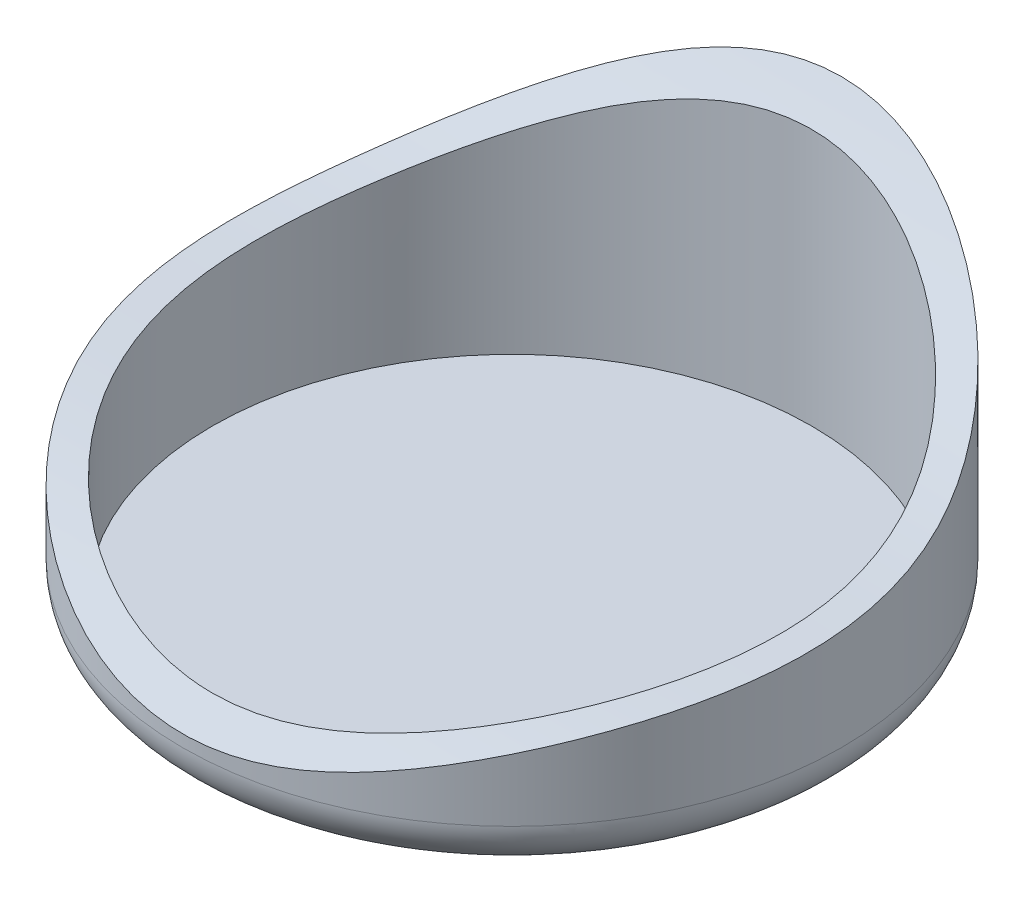
ISO-10303-21;
HEADER;
FILE_DESCRIPTION(('STEP AP214'),'2;1');
FILE_NAME('part.step','',(''),(''),'','','');
FILE_SCHEMA(('AUTOMOTIVE_DESIGN { 1 0 10303 214 1 1 1 1 }'));
ENDSEC;
DATA;
#1=APPLICATION_CONTEXT('core data for automotive mechanical design processes');
#2=APPLICATION_PROTOCOL_DEFINITION('international standard','automotive_design',2000,#1);
#3=PRODUCT_CONTEXT('',#1,'mechanical');
#4=PRODUCT('Part','Part','',(#3));
#5=PRODUCT_RELATED_PRODUCT_CATEGORY('part','',(#4));
#6=PRODUCT_DEFINITION_FORMATION('','',#4);
#7=PRODUCT_DEFINITION_CONTEXT('part definition',#1,'design');
#8=PRODUCT_DEFINITION('design','',#6,#7);
#9=PRODUCT_DEFINITION_SHAPE('','',#8);
#10=(LENGTH_UNIT() NAMED_UNIT(*) SI_UNIT(.MILLI.,.METRE.));
#11=(NAMED_UNIT(*) PLANE_ANGLE_UNIT() SI_UNIT($,.RADIAN.));
#12=(NAMED_UNIT(*) SI_UNIT($,.STERADIAN.) SOLID_ANGLE_UNIT());
#13=UNCERTAINTY_MEASURE_WITH_UNIT(LENGTH_MEASURE(1.E-05),#10,'distance_accuracy_value','');
#14=(GEOMETRIC_REPRESENTATION_CONTEXT(3) GLOBAL_UNCERTAINTY_ASSIGNED_CONTEXT((#13)) GLOBAL_UNIT_ASSIGNED_CONTEXT((#10,
#11,#12)) REPRESENTATION_CONTEXT('',''));
#15=CARTESIAN_POINT('',(0.,0.,0.));
#16=DIRECTION('',(0.,0.,1.));
#17=DIRECTION('',(1.,0.,0.));
#18=AXIS2_PLACEMENT_3D('',#15,#16,#17);
#19=CARTESIAN_POINT('',(0.,50.,0.));
#20=DIRECTION('',(0.,-1.,0.));
#21=DIRECTION('',(0.,0.,-1.));
#22=AXIS2_PLACEMENT_3D('',#19,#20,#21);
#23=CYLINDRICAL_SURFACE('',#22,55.);
#24=CARTESIAN_POINT('',(0.,8.,0.));
#25=DIRECTION('',(0.,1.,0.));
#26=DIRECTION('',(0.,0.,1.));
#27=AXIS2_PLACEMENT_3D('',#24,#25,#26);
#28=CIRCLE('',#27,55.);
#29=CARTESIAN_POINT('',(0.,8.,55.));
#30=VERTEX_POINT('',#29);
#31=EDGE_CURVE('E49',#30,#30,#28,.T.);
#32=ORIENTED_EDGE('',*,*,#31,.T.);
#33=EDGE_LOOP('',(#32));
#34=FACE_BOUND('',#33,.T.);
#35=CARTESIAN_POINT('',(0.,50.,-55.));
#36=CARTESIAN_POINT('',(0.854069115870392,49.999992625064,-54.999996191035));
#37=CARTESIAN_POINT('',(1.70831991411207,49.9777660004917,-54.9800787541194));
#38=CARTESIAN_POINT('',(3.41334942915672,49.8893770497818,-54.9006224824721));
#39=CARTESIAN_POINT('',(4.26412433642764,49.8231752633585,-54.841048062189));
#40=CARTESIAN_POINT('',(5.95779429608254,49.6484593647357,-54.6829784318823));
#41=CARTESIAN_POINT('',(6.80068813200412,49.5399388274347,-54.5844773117295));
#42=CARTESIAN_POINT('',(8.47782313889633,49.2827400179095,-54.3492966156558));
#43=CARTESIAN_POINT('',(9.3120260083913,49.1339288333599,-54.2124906262402));
#44=CARTESIAN_POINT('',(10.9659494369971,48.7996377199141,-53.9022803897119));
#45=CARTESIAN_POINT('',(11.7856723668956,48.614163855537,-53.7288821951405));
#46=CARTESIAN_POINT('',(13.4085593895451,48.2102646362606,-53.3470286634495));
#47=CARTESIAN_POINT('',(14.2117243581065,47.9918410293012,-53.1385751858987));
#48=CARTESIAN_POINT('',(15.7887838466717,47.5292334930132,-52.6913338226463));
#49=CARTESIAN_POINT('',(16.5629312999914,47.2854557145141,-52.4530145337054));
#50=CARTESIAN_POINT('',(18.0926250884293,46.7734391035743,-51.9452249696853));
#51=CARTESIAN_POINT('',(18.8481718760874,46.505200866986,-51.6757554533771));
#52=CARTESIAN_POINT('',(20.3400530494131,45.9479155637186,-51.1069426391914));
#53=CARTESIAN_POINT('',(21.0763875245413,45.6588685939571,-50.8075994804492));
#54=CARTESIAN_POINT('',(22.5292795771078,45.0635328202285,-50.1802502672315));
#55=CARTESIAN_POINT('',(23.245842999863,44.7572491954778,-49.852252806522));
#56=CARTESIAN_POINT('',(24.6592448740862,44.1306319009409,-49.1684650043946));
#57=CARTESIAN_POINT('',(25.3560839326998,43.8102986643984,-48.8126755197273));
#58=CARTESIAN_POINT('',(26.7300087740181,43.1586083349445,-48.074057042306));
#59=CARTESIAN_POINT('',(27.4070929768283,42.8272503648413,-47.6912258952254));
#60=CARTESIAN_POINT('',(29.2782875914583,41.8864853357786,-46.5804967297862));
#61=CARTESIAN_POINT('',(30.4501953752545,41.2678171093686,-45.8227342224061));
#62=CARTESIAN_POINT('',(32.7291915196127,40.0191745639058,-44.2237264055906));
#63=CARTESIAN_POINT('',(33.8362728200181,39.3891990231155,-43.3824720299668));
#64=CARTESIAN_POINT('',(35.9851198478277,38.1312499868894,-41.6173698903432));
#65=CARTESIAN_POINT('',(37.0268453400482,37.5032779463146,-40.6934720809734));
#66=CARTESIAN_POINT('',(39.0419273486149,36.2624289680221,-38.764326917331));
#67=CARTESIAN_POINT('',(40.0152851338796,35.6495517502787,-37.7590810736399));
#68=CARTESIAN_POINT('',(41.5892878261699,34.6431545535262,-36.0033498045493));
#69=CARTESIAN_POINT('',(42.2094213239966,34.2422732776303,-35.2744453649962));
#70=CARTESIAN_POINT('',(43.41478814514,33.4567419740657,-33.7798430810105));
#71=CARTESIAN_POINT('',(44.000021155523,33.072092091944,-33.0141449067797));
#72=CARTESIAN_POINT('',(45.1336837158256,32.3226652097743,-31.4465613871079));
#73=CARTESIAN_POINT('',(45.6821123756887,31.9578886903731,-30.6446751672985));
#74=CARTESIAN_POINT('',(46.739243682609,31.2522636957342,-29.0067535371727));
#75=CARTESIAN_POINT('',(47.2480013361252,30.9113821573175,-28.1707679507125));
#76=CARTESIAN_POINT('',(48.2242394638017,30.2563931325486,-26.4648544639774));
#77=CARTESIAN_POINT('',(48.6917206325427,29.9422851956661,-25.5949271352134));
#78=CARTESIAN_POINT('',(49.5827905112773,29.3442086791091,-23.8228880684401));
#79=CARTESIAN_POINT('',(50.0063826114807,29.0602377714592,-22.9207788235696));
#80=CARTESIAN_POINT('',(50.8084269172449,28.5207954417795,-21.0834732261368));
#81=CARTESIAN_POINT('',(51.1866780361525,28.2654512808639,-20.1481517191868));
#82=CARTESIAN_POINT('',(51.8932263361902,27.7833520468131,-18.251500813062));
#83=CARTESIAN_POINT('',(52.2215175500993,27.5566003893257,-17.2901683232557));
#84=CARTESIAN_POINT('',(52.8257183776272,27.129794061271,-15.3453678902753));
#85=CARTESIAN_POINT('',(53.1016273860588,26.9297396991533,-14.3618996915075));
#86=CARTESIAN_POINT('',(53.599333517663,26.5536262732468,-12.3758067045968));
#87=CARTESIAN_POINT('',(53.8210772584035,26.3775909561619,-11.3731640598427));
#88=CARTESIAN_POINT('',(54.2085382716819,26.0467345655661,-9.3536825026886));
#89=CARTESIAN_POINT('',(54.3742569247168,25.8919129693902,-8.33684394072883));
#90=CARTESIAN_POINT('',(54.648519157302,25.6000976554439,-6.29306704130976));
#91=CARTESIAN_POINT('',(54.7570653485922,25.4631031235167,-5.26612916738858));
#92=CARTESIAN_POINT('',(54.9493621996471,25.1491138797272,-2.77653790213313));
#93=CARTESIAN_POINT('',(55.003932643473,24.9792387214009,-1.31063849075073));
#94=CARTESIAN_POINT('',(54.9956251361627,24.6570605875737,1.62254910854977));
#95=CARTESIAN_POINT('',(54.9327523382722,24.5047568413751,3.08983723270951));
#96=CARTESIAN_POINT('',(54.6897797949711,24.2067816170215,6.01513112153528));
#97=CARTESIAN_POINT('',(54.5096965092104,24.0611092107126,7.47313816050201));
#98=CARTESIAN_POINT('',(54.0335084406365,23.7659055615091,10.3698621247427));
#99=CARTESIAN_POINT('',(53.7373985668483,23.6163741495595,11.8085782007091));
#100=CARTESIAN_POINT('',(53.1356666316899,23.3501024148008,14.236274730053));
#101=CARTESIAN_POINT('',(52.858586443786,23.2366917085476,15.232794792177));
#102=CARTESIAN_POINT('',(52.2490427892081,23.0003627083434,17.2077088567868));
#103=CARTESIAN_POINT('',(51.9165771037337,22.877444033599,18.1861021313492));
#104=CARTESIAN_POINT('',(51.1976708396996,22.6196147810732,20.1212322977192));
#105=CARTESIAN_POINT('',(50.8112301722722,22.4847041835476,21.0779691538673));
#106=CARTESIAN_POINT('',(49.9861537654,22.2009341664183,22.9661835959455));
#107=CARTESIAN_POINT('',(49.5475346563176,22.0520791943765,23.8976691144019));
#108=CARTESIAN_POINT('',(48.6198931015828,21.7389295705646,25.7325245926298));
#109=CARTESIAN_POINT('',(48.130870572264,21.5746348931656,26.635894505728));
#110=CARTESIAN_POINT('',(47.1045359526055,21.2297468825814,28.4115154609878));
#111=CARTESIAN_POINT('',(46.5672254795864,21.0491540952721,29.2837675440209));
#112=CARTESIAN_POINT('',(45.4551023477234,20.6743020373164,30.9814083268508));
#113=CARTESIAN_POINT('',(44.8809858562312,20.4802929308506,31.8073085770574));
#114=CARTESIAN_POINT('',(43.6903491303983,20.0765966559798,33.4239616749198));
#115=CARTESIAN_POINT('',(43.0738286769188,19.8669094065514,34.214714340902));
#116=CARTESIAN_POINT('',(41.8006802299838,19.4328213530191,35.7589788431168));
#117=CARTESIAN_POINT('',(41.1440528782554,19.2084207843301,36.5124912748597));
#118=CARTESIAN_POINT('',(39.7923991441477,18.7462583772949,37.9810704247534));
#119=CARTESIAN_POINT('',(39.0973430589127,18.5084862010798,38.6961065366005));
#120=CARTESIAN_POINT('',(37.671455038648,18.0218322554297,40.0855641657684));
#121=CARTESIAN_POINT('',(36.9406228606016,17.772950410531,40.7599854071345));
#122=CARTESIAN_POINT('',(35.4451939481835,17.2666928541381,42.0669034933099));
#123=CARTESIAN_POINT('',(34.6805966863172,17.0093170099624,42.699399682759));
#124=CARTESIAN_POINT('',(33.0969450368578,16.4816710246908,43.9389616729014));
#125=CARTESIAN_POINT('',(32.2769557261177,16.2112431458961,44.5447660066048));
#126=CARTESIAN_POINT('',(30.6049946211398,15.6685825967561,45.7096539434829));
#127=CARTESIAN_POINT('',(29.7530222098398,15.396349891673,46.268736644567));
#128=CARTESIAN_POINT('',(28.0186610057322,14.854444004396,47.3391295764531));
#129=CARTESIAN_POINT('',(27.1362692348363,14.5847710761219,47.8504351115325));
#130=CARTESIAN_POINT('',(25.3429265957072,14.0529244898544,48.8239358720299));
#131=CARTESIAN_POINT('',(24.4319837463073,13.7907487650694,49.2861447294388));
#132=CARTESIAN_POINT('',(22.5829143970834,13.2790778228051,50.1603200270973));
#133=CARTESIAN_POINT('',(21.6447902463796,13.0295815146204,50.572290793196));
#134=CARTESIAN_POINT('',(19.7430379412461,12.548829016771,51.3445757106649));
#135=CARTESIAN_POINT('',(18.7794133173613,12.3175703195693,51.7048969690511));
#136=CARTESIAN_POINT('',(16.9915345000619,11.9156476221986,52.3165860556892));
#137=CARTESIAN_POINT('',(16.1708849774303,11.7413143381406,52.5760997944323));
#138=CARTESIAN_POINT('',(14.514656234297,11.4125987848676,53.0572167329086));
#139=CARTESIAN_POINT('',(13.6790784833959,11.2582145639639,53.2788236418917));
#140=CARTESIAN_POINT('',(11.9946514135471,10.9725865415723,53.6831303098784));
#141=CARTESIAN_POINT('',(11.1458024024666,10.8413422041489,53.8658309699976));
#142=CARTESIAN_POINT('',(9.43833565310037,10.6051356559163,54.1910672962565));
#143=CARTESIAN_POINT('',(8.57973722629893,10.5001286321153,54.3336714995728));
#144=CARTESIAN_POINT('',(6.85371784863679,10.3186121254354,54.5782583540829));
#145=CARTESIAN_POINT('',(5.98629649605111,10.2421039461854,54.6802391470459));
#146=CARTESIAN_POINT('',(4.24546704219263,10.119527026275,54.8428680719409));
#147=CARTESIAN_POINT('',(3.37205920372628,10.0734569579215,54.9035180067051));
#148=CARTESIAN_POINT('',(1.61878528562685,10.0128400948417,54.9832031339637));
#149=CARTESIAN_POINT('',(0.738907321800054,9.99841842778351,55.0020731445984));
#150=CARTESIAN_POINT('',(-1.02072736531904,10.0018569897273,54.9975658432919));
#151=CARTESIAN_POINT('',(-1.90048407856056,10.0197190996378,54.9741860698053));
#152=CARTESIAN_POINT('',(-3.65659370144804,10.0872466906899,54.8853555574344));
#153=CARTESIAN_POINT('',(-4.53294676752167,10.1369106924284,54.8199067755724));
#154=CARTESIAN_POINT('',(-6.28010291912449,10.2667945152915,54.6473392722672));
#155=CARTESIAN_POINT('',(-7.15089978231031,10.3470439889023,54.5401801106351));
#156=CARTESIAN_POINT('',(-8.88335713143901,10.5360651498042,54.2849208781756));
#157=CARTESIAN_POINT('',(-9.74501732269935,10.6448377541503,54.1368194909953));
#158=CARTESIAN_POINT('',(-11.4567066230267,10.8882806318955,53.8006017387266));
#159=CARTESIAN_POINT('',(-12.3067359922906,11.0229503249247,53.6124862703688));
#160=CARTESIAN_POINT('',(-14.3623301482885,11.3791702468426,53.1063273563798));
#161=CARTESIAN_POINT('',(-15.5606961755749,11.6129505346207,52.7674508790595));
#162=CARTESIAN_POINT('',(-17.9247147863189,12.1181623602449,52.011971017356));
#163=CARTESIAN_POINT('',(-19.090360166475,12.3896021116961,51.5953506700205));
#164=CARTESIAN_POINT('',(-20.811489331001,12.8174731459881,50.9142704246939));
#165=CARTESIAN_POINT('',(-21.3808037533885,12.9635941218489,50.6778086386679));
#166=CARTESIAN_POINT('',(-22.5097744386454,13.2614845339012,50.1865415847113));
#167=CARTESIAN_POINT('',(-23.0694330736091,13.4132525530342,49.9317409039129));
#168=CARTESIAN_POINT('',(-24.7338643890204,13.8753535479539,49.1400619967048));
#169=CARTESIAN_POINT('',(-25.823997719148,14.192459536378,48.5759444546693));
#170=CARTESIAN_POINT('',(-27.5375388561711,14.7079004990671,47.6154414750163));
#171=CARTESIAN_POINT('',(-28.1744659020274,14.9034234926505,47.2413454608024));
#172=CARTESIAN_POINT('',(-29.432465248496,15.2959296496337,46.4680003026634));
#173=CARTESIAN_POINT('',(-30.0535373706331,15.4929128294383,46.0687508757676));
#174=CARTESIAN_POINT('',(-31.2791811890868,15.8866292937793,45.2455285884988));
#175=CARTESIAN_POINT('',(-31.8837521935702,16.0833625675092,44.8215546938473));
#176=CARTESIAN_POINT('',(-33.0757781285597,16.475027024464,43.9492705829832));
#177=CARTESIAN_POINT('',(-33.6632314109112,16.6699580329347,43.5009580351797));
#178=CARTESIAN_POINT('',(-34.8202798515112,17.056578671491,42.5804492788901));
#179=CARTESIAN_POINT('',(-35.3898740082778,17.2482681195236,42.1082517348771));
#180=CARTESIAN_POINT('',(-36.5103457673659,17.6270897104325,41.1405224075707));
#181=CARTESIAN_POINT('',(-37.0612252912207,17.8142223206221,40.6449930324251));
#182=CARTESIAN_POINT('',(-38.1435618268317,18.1828338765048,39.6310307513094));
#183=CARTESIAN_POINT('',(-38.6750171326413,18.3643123254115,39.1125958424334));
#184=CARTESIAN_POINT('',(-39.7175421652234,18.7206108510848,38.0535019384331));
#185=CARTESIAN_POINT('',(-40.2286129534817,18.8954312745343,37.512844103511));
#186=CARTESIAN_POINT('',(-41.4447197382046,19.3111819821526,36.172765757434));
#187=CARTESIAN_POINT('',(-42.1386835897875,19.5482220038416,35.3620282993949));
#188=CARTESIAN_POINT('',(-43.4804443348035,20.0052737414143,33.6985605588724));
#189=CARTESIAN_POINT('',(-44.1282376706105,20.2252841452087,32.8458270489646));
#190=CARTESIAN_POINT('',(-45.3748650399899,20.6472717069314,31.1009837016488));
#191=CARTESIAN_POINT('',(-45.9736987747784,20.8492487548088,30.2088736239899));
#192=CARTESIAN_POINT('',(-47.1195834515449,21.2348989193703,28.3884028005701));
#193=CARTESIAN_POINT('',(-47.6666434039877,21.4185752213247,27.4600484024712));
#194=CARTESIAN_POINT('',(-48.706532927573,21.7682016991106,25.570234302467));
#195=CARTESIAN_POINT('',(-49.1993626543734,21.9341519258214,24.6087746955946));
#196=CARTESIAN_POINT('',(-50.1284374280563,22.2496023410076,22.6563089371848));
#197=CARTESIAN_POINT('',(-50.564686302152,22.3991036420089,21.6653047896669));
#198=CARTESIAN_POINT('',(-51.2583563199886,22.6416300800625,19.9540427687576));
#199=CARTESIAN_POINT('',(-51.5305461943378,22.7382968986456,19.2402403165099));
#200=CARTESIAN_POINT('',(-52.0452101747104,22.925356911125,17.8011242988975));
#201=CARTESIAN_POINT('',(-52.2876826056578,23.0157497512531,17.0758100872524));
#202=CARTESIAN_POINT('',(-52.7423005335627,23.1912644888894,15.6152076664852));
#203=CARTESIAN_POINT('',(-52.9544494096698,23.2763869731073,14.8799205787191));
#204=CARTESIAN_POINT('',(-53.347997324022,23.442532953943,13.4006349043974));
#205=CARTESIAN_POINT('',(-53.5293936498628,23.5235560885526,12.6566355555927));
#206=CARTESIAN_POINT('',(-53.8610743909684,23.6827861766284,11.1611597673209));
#207=CARTESIAN_POINT('',(-54.0113478633303,23.7609921316077,10.4096807949955));
#208=CARTESIAN_POINT('',(-54.2803853670528,23.9159172656208,8.90095135311363));
#209=CARTESIAN_POINT('',(-54.3991493168382,23.992636440805,8.1437008686205));
#210=CARTESIAN_POINT('',(-54.6049328210034,24.1460286974508,6.62484940842192));
#211=CARTESIAN_POINT('',(-54.6919507498753,24.2227017763515,5.86324821197208));
#212=CARTESIAN_POINT('',(-54.8340700845371,24.3774872829768,4.33727923389892));
#213=CARTESIAN_POINT('',(-54.8891732218707,24.4555996323762,3.57291160463361));
#214=CARTESIAN_POINT('',(-54.9810851156884,24.6426947827262,1.77481680662594));
#215=CARTESIAN_POINT('',(-55.0047264714241,24.7529075165226,0.740515366857586));
#216=CARTESIAN_POINT('',(-54.9937115178906,24.9826038386612,-1.32672344500741));
#217=CARTESIAN_POINT('',(-54.9590552089206,25.1020874269559,-2.35966081711105));
#218=CARTESIAN_POINT('',(-54.8317958722051,25.3541495540538,-4.42038482293859));
#219=CARTESIAN_POINT('',(-54.7391923858916,25.4867281964783,-5.44817141583666));
#220=CARTESIAN_POINT('',(-54.4968224082301,25.7685478848253,-7.49374006605367));
#221=CARTESIAN_POINT('',(-54.3471074424986,25.9177738260452,-8.51153029550268));
#222=CARTESIAN_POINT('',(-53.9915523943427,26.2364366855096,-10.5340672209118));
#223=CARTESIAN_POINT('',(-53.7857122547662,26.4058736243348,-11.5388139035887));
#224=CARTESIAN_POINT('',(-53.319328225979,26.7680799347147,-13.5312938669418));
#225=CARTESIAN_POINT('',(-53.0587855309357,26.9608487968901,-14.5190275185066));
#226=CARTESIAN_POINT('',(-52.5620920153792,27.3169821661118,-16.2105202172787));
#227=CARTESIAN_POINT('',(-52.3382332886139,27.474307254433,-16.9191942304071));
#228=CARTESIAN_POINT('',(-51.8631423601903,27.8036810634934,-18.323866262331));
#229=CARTESIAN_POINT('',(-51.6119098753841,27.975729936528,-19.0198641499206));
#230=CARTESIAN_POINT('',(-51.0830663737456,28.3352084546082,-20.3976681572434));
#231=CARTESIAN_POINT('',(-50.805456644969,28.5226373485543,-21.0794749679763));
#232=CARTESIAN_POINT('',(-50.224932666494,28.9133534977363,-22.4275409672988));
#233=CARTESIAN_POINT('',(-49.9220209474938,29.1166391668475,-23.093801702295));
#234=CARTESIAN_POINT('',(-49.4495446318585,29.433673473602,-24.0806066239731));
#235=CARTESIAN_POINT('',(-49.2890220979707,29.5413774647867,-24.4074671634394));
#236=CARTESIAN_POINT('',(-48.9620872534847,29.7608244856789,-25.0568584784718));
#237=CARTESIAN_POINT('',(-48.7956749427601,29.872567515473,-25.3793892539451));
#238=CARTESIAN_POINT('',(-48.2877833345961,30.2136162097771,-26.3403686401113));
#239=CARTESIAN_POINT('',(-47.9376452452216,30.4487442427836,-26.9722128980282));
#240=CARTESIAN_POINT('',(-47.2153055166517,30.9332149511956,-28.2176046530406));
#241=CARTESIAN_POINT('',(-46.8431020978285,31.1825587730803,-28.8311506683192));
#242=CARTESIAN_POINT('',(-46.0776140128486,31.694086086304,-30.0393896509177));
#243=CARTESIAN_POINT('',(-45.6843301959714,31.956269060347,-30.6340833762181));
#244=CARTESIAN_POINT('',(-44.758656636824,32.5710696454516,-31.9766982915616));
#245=CARTESIAN_POINT('',(-44.2194237260526,32.9275714347158,-32.7181373934191));
#246=CARTESIAN_POINT('',(-43.1088473780454,33.656709495157,-34.1681322436399));
#247=CARTESIAN_POINT('',(-42.5375064632129,34.0293444983828,-34.8766905671534));
#248=CARTESIAN_POINT('',(-41.3641467434828,34.787660184785,-36.2605893160665));
#249=CARTESIAN_POINT('',(-40.7621286746782,35.1733405548656,-36.9359305377413));
#250=CARTESIAN_POINT('',(-39.5275095386878,35.9552856399836,-38.2543214791725));
#251=CARTESIAN_POINT('',(-38.8948550744557,36.3515682537161,-38.8973105215926));
#252=CARTESIAN_POINT('',(-37.6009351991512,37.1507850739798,-40.1494735395982));
#253=CARTESIAN_POINT('',(-36.9396696135666,37.5537193210731,-40.7586473088774));
#254=CARTESIAN_POINT('',(-35.5892055641678,38.3628940588503,-41.9429987778972));
#255=CARTESIAN_POINT('',(-34.9000045451433,38.76913484925,-42.5181733559024));
#256=CARTESIAN_POINT('',(-33.3543615908339,39.6621884633753,-43.745222189444));
#257=CARTESIAN_POINT('',(-32.4919215891232,40.1489552890134,-44.3895966609254));
#258=CARTESIAN_POINT('',(-30.7280595199283,41.1157902618846,-45.6283681494319));
#259=CARTESIAN_POINT('',(-29.826632274882,41.5958575081378,-46.2227584974418));
#260=CARTESIAN_POINT('',(-27.9847680204105,42.5424339950318,-47.3605840161798));
#261=CARTESIAN_POINT('',(-27.0443182562064,43.0089387165755,-47.9040023340746));
#262=CARTESIAN_POINT('',(-25.1263128390318,43.9198437850056,-48.937235031649));
#263=CARTESIAN_POINT('',(-24.1488200243353,44.3642788492797,-49.4271351574015));
#264=CARTESIAN_POINT('',(-22.1558032859289,45.2233394241871,-50.3520303040028));
#265=CARTESIAN_POINT('',(-21.1402902190651,45.6379733473994,-50.7870408460675));
#266=CARTESIAN_POINT('',(-19.0721543305148,46.428167059024,-51.5992829685869));
#267=CARTESIAN_POINT('',(-18.0195535831354,46.803749581607,-51.9765482271311));
#268=CARTESIAN_POINT('',(-16.2574638179544,47.3818525248241,-52.5473460465424));
#269=CARTESIAN_POINT('',(-15.558339885769,47.5985891452374,-52.7586594120585));
#270=CARTESIAN_POINT('',(-14.1459477814543,48.0089487427808,-53.1547736085202));
#271=CARTESIAN_POINT('',(-13.4326809093402,48.2025738329368,-53.339576863527));
#272=CARTESIAN_POINT('',(-11.9929807140362,48.564005846863,-53.6816160424518));
#273=CARTESIAN_POINT('',(-11.2665456897086,48.7318094079037,-53.8388483761888));
#274=CARTESIAN_POINT('',(-9.80443748580677,49.0384479526978,-54.1241715621028));
#275=CARTESIAN_POINT('',(-9.06880179463937,49.1773748950343,-54.2523550428501));
#276=CARTESIAN_POINT('',(-7.58794368340024,49.4245641887451,-54.4792081303766));
#277=CARTESIAN_POINT('',(-6.84272231803851,49.5328298841039,-54.57788095572));
#278=CARTESIAN_POINT('',(-5.34534667223215,49.7166704791994,-54.7448109916503));
#279=CARTESIAN_POINT('',(-4.59319727535835,49.7922668387327,-54.8130881693875));
#280=CARTESIAN_POINT('',(-3.20123558454131,49.9003163337452,-54.9104762710546));
#281=CARTESIAN_POINT('',(-2.5621109190416,49.9376452647518,-54.9440219876641));
#282=CARTESIAN_POINT('',(-1.6021208950689,49.975028146579,-54.9775935784364));
#283=CARTESIAN_POINT('',(-1.28187493528355,49.9843873597677,-54.9859929469241));
#284=CARTESIAN_POINT('',(-0.641094548679899,49.9968754073273,-54.9971975341));
#285=CARTESIAN_POINT('',(-0.320560071559227,50.0000027680547,-55.0000014296291));
#286=CARTESIAN_POINT('',(0.,50.,-55.));
#287=B_SPLINE_CURVE_WITH_KNOTS('',3,(#35,#36,#37,#38,#39,#40,#41,#42,#43,#44,#45,#46,#47,#48,
#49,#50,#51,#52,#53,#54,#55,#56,#57,#58,#59,#60,#61,#62,#63,#64,#65,#66,#67,#68,#69,#70,#71,#72,
#73,#74,#75,#76,#77,#78,#79,#80,#81,#82,#83,#84,#85,#86,#87,#88,#89,#90,#91,#92,#93,#94,#95,#96,
#97,#98,#99,#100,#101,#102,#103,#104,#105,#106,#107,#108,#109,#110,#111,#112,#113,#114,#115,
#116,#117,#118,#119,#120,#121,#122,#123,#124,#125,#126,#127,#128,#129,#130,#131,#132,#133,#134,
#135,#136,#137,#138,#139,#140,#141,#142,#143,#144,#145,#146,#147,#148,#149,#150,#151,#152,#153,
#154,#155,#156,#157,#158,#159,#160,#161,#162,#163,#164,#165,#166,#167,#168,#169,#170,#171,#172,
#173,#174,#175,#176,#177,#178,#179,#180,#181,#182,#183,#184,#185,#186,#187,#188,#189,#190,#191,
#192,#193,#194,#195,#196,#197,#198,#199,#200,#201,#202,#203,#204,#205,#206,#207,#208,#209,#210,
#211,#212,#213,#214,#215,#216,#217,#218,#219,#220,#221,#222,#223,#224,#225,#226,#227,#228,#229,
#230,#231,#232,#233,#234,#235,#236,#237,#238,#239,#240,#241,#242,#243,#244,#245,#246,#247,#248,
#249,#250,#251,#252,#253,#254,#255,#256,#257,#258,#259,#260,#261,#262,#263,#264,#265,#266,#267,
#268,#269,#270,#271,#272,#273,#274,#275,#276,#277,#278,#279,#280,#281,#282,#283,#284,#285,#286),
.UNSPECIFIED.,.T.,.F.,(4,2,2,2,2,2,2,2,2,2,2,2,2,2,2,2,2,2,2,2,2,2,2,2,2,2,2,2,2,2,2,2,2,2,2,2,
2,2,2,2,2,2,2,2,2,2,2,2,2,2,2,2,2,2,2,2,2,2,2,2,2,2,2,2,2,2,2,2,2,2,2,2,2,2,2,2,2,2,2,2,2,2,2,2,
2,2,2,2,2,2,2,2,2,2,2,2,2,2,2,2,2,2,2,2,2,2,2,2,2,2,2,2,2,2,2,2,2,2,2,2,2,2,2,2,2,4),(0.,
2.56200694969996,5.12631597945433,7.69101449057014,10.2642788412174,12.837117893675,
15.4098205084209,17.9462878776894,20.4826934755588,23.0190872607623,25.5547229457728,
28.0902804950225,30.6260402727003,35.2014980365665,39.7774531835112,44.3561983410306,
48.9348584936522,52.0463801870225,55.1579297755065,58.2695545849186,61.3767852295016,
64.4839635771278,67.5909017316199,70.7111457601362,73.8317621792123,76.9524146495025,
80.0761303726221,83.1997691196147,86.3232651608412,90.7483241103604,95.1731888990267,
99.597432446227,104.021870140623,107.141895935076,110.262046751068,113.382202704337,
116.501366849569,119.620536172494,122.73960106318,125.811140690785,128.882696192951,
131.954202561819,135.02811712448,138.102052570259,141.176036055573,144.33877143327,
147.501567862228,150.66467481667,153.826901206827,156.988855114747,160.150373516608,
162.78383163566,165.417031918611,168.050171206829,170.67878190249,173.307512824504,
175.936129075193,178.575119451227,181.214263584351,183.853284955135,186.494871381173,
189.13654274799,191.778154920197,195.57577560303,199.374225860477,201.27455386043,
203.174408169763,206.974430271241,209.266263231259,211.558121978537,213.85007666815,
216.142251310898,218.434554262324,220.726621134762,223.018888828336,225.311037000091,
228.588623990354,231.866463259607,235.144322530927,238.421610285994,241.698888633961,
244.975945186196,247.285399856238,249.594984642948,251.904311856702,254.213842649463,
256.524184107791,258.834531547311,261.144997268151,263.455337622453,266.574875215355,
269.694412792239,272.813975056051,275.93072950143,279.047487120598,282.164176707411,
284.442466618957,286.720780098843,288.998982381053,291.2769570703,292.416109755935,
293.555262466008,295.833538164492,298.111997862649,300.39036583593,303.340055748488,
306.289514256601,309.238902026259,312.193629650937,315.14837530038,318.103391828386,
321.646175668494,325.189431448773,328.733854633107,332.27251302634,335.810168534258,
339.345752891053,341.63045360668,343.914945277941,346.199734206498,348.477131733261,
350.754280786199,353.02993174593,354.952302242228,355.913679931384,356.875284930172),.UNSPECIFIED.);
#288=CARTESIAN_POINT('',(0.,50.,-55.));
#289=VERTEX_POINT('',#288);
#290=EDGE_CURVE('E71',#289,#289,#287,.T.);
#291=ORIENTED_EDGE('',*,*,#290,.T.);
#292=EDGE_LOOP('',(#291));
#293=FACE_BOUND('',#292,.T.);
#294=ADVANCED_FACE('F41',(#34,#293),#23,.T.);
#295=CARTESIAN_POINT('',(0.,0.,0.));
#296=DIRECTION('',(0.,1.,0.));
#297=DIRECTION('',(0.,0.,1.));
#298=AXIS2_PLACEMENT_3D('',#295,#296,#297);
#299=PLANE('',#298);
#300=CARTESIAN_POINT('',(0.,0.,0.));
#301=DIRECTION('',(0.,1.,0.));
#302=DIRECTION('',(0.,0.,1.));
#303=AXIS2_PLACEMENT_3D('',#300,#301,#302);
#304=CIRCLE('',#303,47.);
#305=CARTESIAN_POINT('',(0.,0.,47.));
#306=VERTEX_POINT('',#305);
#307=EDGE_CURVE('E10',#306,#306,#304,.F.);
#308=ORIENTED_EDGE('',*,*,#307,.T.);
#309=EDGE_LOOP('',(#308));
#310=FACE_BOUND('',#309,.T.);
#311=CARTESIAN_POINT('',(0.,0.,0.));
#312=DIRECTION('',(0.,-1.,0.));
#313=DIRECTION('',(0.,0.,-1.));
#314=AXIS2_PLACEMENT_3D('',#311,#312,#313);
#315=CIRCLE('',#314,45.);
#316=CARTESIAN_POINT('',(0.,0.,-45.));
#317=VERTEX_POINT('',#316);
#318=EDGE_CURVE('E54',#317,#317,#315,.T.);
#319=ORIENTED_EDGE('',*,*,#318,.F.);
#320=EDGE_LOOP('',(#319));
#321=FACE_BOUND('',#320,.T.);
#322=ADVANCED_FACE('F84',(#310,#321),#299,.F.);
#323=CARTESIAN_POINT('',(-64.,10.,55.));
#324=CARTESIAN_POINT('',(-64.,27.4052914409848,32.1855750526101));
#325=CARTESIAN_POINT('',(-64.,18.2029956521843,-13.1906804716222));
#326=CARTESIAN_POINT('',(-64.,40.2895559548534,-46.2899029569435));
#327=CARTESIAN_POINT('',(-64.,50.,-55.));
#328=B_SPLINE_CURVE_WITH_KNOTS('',3,(#323,#324,#325,#326,#327),.UNSPECIFIED.,.F.,.F.,(4,1,4),
(0.,0.690633178431917,1.),.UNSPECIFIED.);
#329=DIRECTION('',(1.,0.,0.));
#330=VECTOR('',#329,1.);
#331=SURFACE_OF_LINEAR_EXTRUSION('',#328,#330);
#332=CARTESIAN_POINT('',(0.,13.3717940304652,50.));
#333=CARTESIAN_POINT('',(0.881159904057266,13.371795840602,49.9999989948074));
#334=CARTESIAN_POINT('',(1.7623426963259,13.385650150989,49.9766925835683));
#335=CARTESIAN_POINT('',(3.5217000198749,13.4406999602166,49.8836042952436));
#336=CARTESIAN_POINT('',(4.3998733139764,13.4819055994411,49.8138051811607));
#337=CARTESIAN_POINT('',(6.14974348791959,13.5905511566519,49.6281657633903));
#338=CARTESIAN_POINT('',(7.02143999255763,13.6579925825996,49.5123228132203));
#339=CARTESIAN_POINT('',(8.75680116328075,13.817475712535,49.2350675746496));
#340=CARTESIAN_POINT('',(9.62044954693586,13.9095592837089,49.0735777052796));
#341=CARTESIAN_POINT('',(11.3354337356374,14.1159526960125,48.7060262816744));
#342=CARTESIAN_POINT('',(12.186770327416,14.2302611101564,48.4999675889644));
#343=CARTESIAN_POINT('',(13.8747733772549,14.4783972228069,48.0443017372284));
#344=CARTESIAN_POINT('',(14.7114401279356,14.6122245314712,47.7946954479394));
#345=CARTESIAN_POINT('',(16.3629034134784,14.8955606120751,47.2546875169916));
#346=CARTESIAN_POINT('',(17.1778030946128,15.0449674475855,46.9645473054784));
#347=CARTESIAN_POINT('',(18.7892339786063,15.3571047205318,46.343395787129));
#348=CARTESIAN_POINT('',(19.5857654137126,15.5198349893884,46.012384997395));
#349=CARTESIAN_POINT('',(21.1588480333882,15.8555722677573,45.3105391511795));
#350=CARTESIAN_POINT('',(21.9353992462723,16.0285792627049,44.9397041511381));
#351=CARTESIAN_POINT('',(23.4670561811651,16.3818923466211,44.1592130205151));
#352=CARTESIAN_POINT('',(24.2221611848834,16.5621986795744,43.7495555916556));
#353=CARTESIAN_POINT('',(25.7094722552607,16.9272483757996,42.8924202745448));
#354=CARTESIAN_POINT('',(26.441678515926,17.1119917014561,42.4449427068384));
#355=CARTESIAN_POINT('',(27.8818376991189,17.4832504331645,41.5131157869079));
#356=CARTESIAN_POINT('',(28.5897889594523,17.6697659595509,41.0287639149889));
#357=CARTESIAN_POINT('',(30.0430565351874,18.0589894261693,39.9786152280632));
#358=CARTESIAN_POINT('',(30.7859355898309,18.2616312012393,39.4094160361218));
#359=CARTESIAN_POINT('',(32.239218680302,18.6632234350488,38.2296844817774));
#360=CARTESIAN_POINT('',(32.9496210868183,18.8621737082936,37.6191500494429));
#361=CARTESIAN_POINT('',(34.3359513152304,19.2539099221466,36.3582231570168));
#362=CARTESIAN_POINT('',(35.0118785644185,19.4466957603303,35.7078300351801));
#363=CARTESIAN_POINT('',(36.3270282125542,19.8240096143397,34.3689876717462));
#364=CARTESIAN_POINT('',(36.9662596311479,20.0085396569157,33.6805478641885));
#365=CARTESIAN_POINT('',(38.2060932677208,20.3678071373287,32.2672903084806));
#366=CARTESIAN_POINT('',(38.8066958632192,20.5425446708657,31.5424729159716));
#367=CARTESIAN_POINT('',(39.9671604162291,20.8811252321389,30.0584975866534));
#368=CARTESIAN_POINT('',(40.5270227860299,21.0449683701244,29.2993399974917));
#369=CARTESIAN_POINT('',(41.6079677786925,21.3623425560972,27.7431299218719));
#370=CARTESIAN_POINT('',(42.1287287166842,21.5157872246542,26.9458362948035));
#371=CARTESIAN_POINT('',(43.1247624782332,21.8109122452648,25.3211919264194));
#372=CARTESIAN_POINT('',(43.600034132606,21.9525922949269,24.4938404132968));
#373=CARTESIAN_POINT('',(44.5031568793908,22.2245992837559,22.8118435316973));
#374=CARTESIAN_POINT('',(44.9310081555184,22.3549262669063,21.9571982689779));
#375=CARTESIAN_POINT('',(45.7376016716025,22.6051567736086,20.223403813377));
#376=CARTESIAN_POINT('',(46.1163369427169,22.7250588172206,19.3442511647092));
#377=CARTESIAN_POINT('',(46.8230750787552,22.9557934427993,17.5646324963185));
#378=CARTESIAN_POINT('',(47.1510778157871,23.0666260019025,16.664166422873));
#379=CARTESIAN_POINT('',(47.7550185141439,23.2810169601368,14.8450842730665));
#380=CARTESIAN_POINT('',(48.0309577161712,23.3845755325741,13.926468629796));
#381=CARTESIAN_POINT('',(48.4623654252429,23.5593213328721,12.3243492033098));
#382=CARTESIAN_POINT('',(48.6302498624363,23.6317033771978,11.6442882663425));
#383=CARTESIAN_POINT('',(48.9373478677115,23.7747033567012,10.2774788422307));
#384=CARTESIAN_POINT('',(49.0765597171022,23.8453211859057,9.5907299567801));
#385=CARTESIAN_POINT('',(49.3259985951531,23.9857989367346,8.21198100541064));
#386=CARTESIAN_POINT('',(49.4362282322925,24.0556589260238,7.51998141784128));
#387=CARTESIAN_POINT('',(49.6275150977584,24.1957150517823,6.13193263990898));
#388=CARTESIAN_POINT('',(49.7085697958679,24.265911216872,5.43588310362823));
#389=CARTESIAN_POINT('',(49.8413506324276,24.407762804142,4.04110706841308));
#390=CARTESIAN_POINT('',(49.8930754212833,24.4794182933149,3.34238044778369));
#391=CARTESIAN_POINT('',(49.9671166056349,24.6253412506818,1.94364342153614));
#392=CARTESIAN_POINT('',(49.989433019316,24.6996087172607,1.24363301671209));
#393=CARTESIAN_POINT('',(50.0046556480736,24.851929199503,-0.156328286149594));
#394=CARTESIAN_POINT('',(49.9975607706415,24.9299823556829,-0.856279181010871));
#395=CARTESIAN_POINT('',(49.954038336407,25.091030441892,-2.25464285893142));
#396=CARTESIAN_POINT('',(49.9176124656296,25.1740250876169,-2.95305572808672));
#397=CARTESIAN_POINT('',(49.7979559941258,25.3758311176561,-4.58773555126212));
#398=CARTESIAN_POINT('',(49.7029068000531,25.4971143443027,-5.5228596984898));
#399=CARTESIAN_POINT('',(49.4606059412743,25.7533916407167,-7.38441502558667));
#400=CARTESIAN_POINT('',(49.3133536838689,25.8883858661427,-8.31084610663458));
#401=CARTESIAN_POINT('',(48.9675640070017,26.1745548809643,-10.1515810859048));
#402=CARTESIAN_POINT('',(48.7690263165066,26.325729755869,-11.0658849200102));
#403=CARTESIAN_POINT('',(48.322078244987,26.6462991197353,-12.8781626827928));
#404=CARTESIAN_POINT('',(48.0737089345763,26.8156785516918,-13.7761493994778));
#405=CARTESIAN_POINT('',(47.5285343111901,27.174553305187,-15.5532059697987));
#406=CARTESIAN_POINT('',(47.2317289565541,27.3640486440277,-16.4322758071633));
#407=CARTESIAN_POINT('',(46.5915404112413,27.7644944870704,-18.1682173272489));
#408=CARTESIAN_POINT('',(46.2481606896468,27.9754433930154,-19.0250906576163));
#409=CARTESIAN_POINT('',(45.5299568725734,28.4117353958133,-20.6835760028558));
#410=CARTESIAN_POINT('',(45.1566905309069,28.6362970543313,-21.4860690271899));
#411=CARTESIAN_POINT('',(44.3708593875994,29.106467622663,-23.0652250683779));
#412=CARTESIAN_POINT('',(43.9582947709994,29.3520764333728,-23.8418882068321));
#413=CARTESIAN_POINT('',(43.0960920323693,29.8641526595522,-25.3671936610255));
#414=CARTESIAN_POINT('',(42.6464550938497,30.1306194091315,-26.1158368701749));
#415=CARTESIAN_POINT('',(41.7115875820135,30.6820120616772,-27.5844483844139));
#416=CARTESIAN_POINT('',(41.2263274632435,30.9669532637344,-28.3043921052159));
#417=CARTESIAN_POINT('',(40.2222578398309,31.5523415378695,-29.7139494096122));
#418=CARTESIAN_POINT('',(39.70344721251,31.8527891287593,-30.4035619769566));
#419=CARTESIAN_POINT('',(38.6338315607366,32.4663351522566,-31.751653044839));
#420=CARTESIAN_POINT('',(38.0830254007144,32.7794340337571,-32.4101304388365));
#421=CARTESIAN_POINT('',(36.9274261532306,33.4284612051602,-33.7218089580227));
#422=CARTESIAN_POINT('',(36.3213432028991,33.764798403932,-34.3736710664355));
#423=CARTESIAN_POINT('',(35.077296430032,34.4445769421988,-35.6422861045297));
#424=CARTESIAN_POINT('',(34.4393328415623,34.7880182295251,-36.2590392919078));
#425=CARTESIAN_POINT('',(33.1325631483208,35.4784997404933,-37.4568943475395));
#426=CARTESIAN_POINT('',(32.4637554271944,35.8255401520033,-38.0379943436975));
#427=CARTESIAN_POINT('',(31.0959458023609,36.5196659793836,-39.1641065328061));
#428=CARTESIAN_POINT('',(30.3969323531423,36.8667513609915,-39.7091047213391));
#429=CARTESIAN_POINT('',(28.9696886933426,37.5569747771655,-40.7620348600563));
#430=CARTESIAN_POINT('',(28.2414599756113,37.900113012274,-41.2699687004353));
#431=CARTESIAN_POINT('',(26.7564325626588,38.5783676111528,-42.2478845786381));
#432=CARTESIAN_POINT('',(25.9996351348172,38.9134843297024,-42.7178682971276));
#433=CARTESIAN_POINT('',(24.1759105324829,39.6918102430532,-43.7836994486204));
#434=CARTESIAN_POINT('',(23.0967863140946,40.1297281605363,-44.3627159224655));
#435=CARTESIAN_POINT('',(20.8879446230245,40.9708753085084,-45.4445412697716));
#436=CARTESIAN_POINT('',(19.7582267685769,41.3741042771769,-45.9473495680609));
#437=CARTESIAN_POINT('',(17.4521941645482,42.1327122282571,-46.8717464233338));
#438=CARTESIAN_POINT('',(16.275951956424,42.4881621756481,-47.2934558448437));
#439=CARTESIAN_POINT('',(14.4793060782415,42.9759871717915,-47.8617229936176));
#440=CARTESIAN_POINT('',(13.8750186411131,43.1310425277587,-48.0404351299607));
#441=CARTESIAN_POINT('',(12.6563713860658,43.4244494348904,-48.375773793945));
#442=CARTESIAN_POINT('',(12.0420127583361,43.562802943905,-48.5324029105987));
#443=CARTESIAN_POINT('',(10.7473822842008,43.8330948358131,-48.836210450025));
#444=CARTESIAN_POINT('',(10.0662301620599,43.9632829856605,-48.9812068886542));
#445=CARTESIAN_POINT('',(8.69453011582219,44.1999988695229,-49.2431988046534));
#446=CARTESIAN_POINT('',(8.00398293190569,44.3065284561288,-49.3601964745312));
#447=CARTESIAN_POINT('',(6.61523005773897,44.4942807279114,-49.5654251387153));
#448=CARTESIAN_POINT('',(5.9170247501542,44.5755046716649,-49.6536575636717));
#449=CARTESIAN_POINT('',(4.51555960140028,44.7112571780691,-49.8006595079274));
#450=CARTESIAN_POINT('',(3.81230482163122,44.7658094766536,-49.8594552249998));
#451=CARTESIAN_POINT('',(2.40229233968243,44.847396219645,-49.9472518748881));
#452=CARTESIAN_POINT('',(1.69553441885064,44.8744289240904,-49.9762509237725));
#453=CARTESIAN_POINT('',(0.280928396059877,44.900495525866,-50.0042151420649));
#454=CARTESIAN_POINT('',(-0.426919670061328,44.8995303247583,-50.0031812785642));
#455=CARTESIAN_POINT('',(-1.84156537495623,44.8696156177325,-49.9710852886617));
#456=CARTESIAN_POINT('',(-2.54836260535386,44.8406571614836,-49.9400135582018));
#457=CARTESIAN_POINT('',(-3.95835868466197,44.7552495141532,-49.8480747993539));
#458=CARTESIAN_POINT('',(-4.66155742878993,44.6987995271107,-49.7872069082789));
#459=CARTESIAN_POINT('',(-6.06209267629689,44.5593765795849,-49.6361471310166));
#460=CARTESIAN_POINT('',(-6.75942952456706,44.4764051908871,-49.5459569826015));
#461=CARTESIAN_POINT('',(-8.14706719981327,44.2851892336162,-49.3367834531937));
#462=CARTESIAN_POINT('',(-8.83735926906401,44.1769164554519,-49.2177679281295));
#463=CARTESIAN_POINT('',(-10.2084032791291,43.9368186092988,-48.9517738297878));
#464=CARTESIAN_POINT('',(-10.8891548356413,43.804992595484,-48.8047941335392));
#465=CARTESIAN_POINT('',(-12.2396718114068,43.5196884325887,-48.48373231203));
#466=CARTESIAN_POINT('',(-12.9094361188377,43.3662081071672,-48.3096474624156));
#467=CARTESIAN_POINT('',(-14.4306776719156,42.9919277496954,-47.8805740771297));
#468=CARTESIAN_POINT('',(-15.2780772336574,42.764560022657,-47.6168079190414));
#469=CARTESIAN_POINT('',(-16.9506253412689,42.281637655044,-47.0473919163531));
#470=CARTESIAN_POINT('',(-17.7757682038546,42.0260758983085,-46.7417314929184));
#471=CARTESIAN_POINT('',(-19.4022968988239,41.4913812018962,-46.0903291070142));
#472=CARTESIAN_POINT('',(-20.2036805691709,41.2122461259373,-45.7445835108499));
#473=CARTESIAN_POINT('',(-21.7827301003573,40.634490669958,-45.0141148091133));
#474=CARTESIAN_POINT('',(-22.5603610148855,40.3358434346997,-44.6293375628898));
#475=CARTESIAN_POINT('',(-24.0899246038533,39.7237379794033,-43.8226316164185));
#476=CARTESIAN_POINT('',(-24.8418604847248,39.4102816190831,-43.400707575319));
#477=CARTESIAN_POINT('',(-26.3195910783145,38.7725682319847,-42.5208023855962));
#478=CARTESIAN_POINT('',(-27.0453852865131,38.4483109969879,-42.0628205416203));
#479=CARTESIAN_POINT('',(-28.4857994571134,37.7856962513312,-41.1014017414242));
#480=CARTESIAN_POINT('',(-29.1998336218891,37.4471854536077,-40.5971931420824));
#481=CARTESIAN_POINT('',(-30.5994700712057,36.7667397328512,-39.5529364761607));
#482=CARTESIAN_POINT('',(-31.2850726950256,36.4248048507388,-39.012888837455));
#483=CARTESIAN_POINT('',(-32.6271619401389,35.7411627726536,-37.8976193128604));
#484=CARTESIAN_POINT('',(-33.2836486393563,35.3994555760738,-37.322397521119));
#485=CARTESIAN_POINT('',(-34.5664076491654,34.7198942499107,-36.1375906477696));
#486=CARTESIAN_POINT('',(-35.192691531217,34.3820386831689,-35.5280189237362));
#487=CARTESIAN_POINT('',(-36.4142749175748,33.7134052385645,-34.2748632230742));
#488=CARTESIAN_POINT('',(-37.0095740577606,33.3826274439039,-33.6312788469214));
#489=CARTESIAN_POINT('',(-38.1680251630424,32.7313512737097,-32.310578689855));
#490=CARTESIAN_POINT('',(-38.7311718831145,32.4108545790469,-31.6334574715309));
#491=CARTESIAN_POINT('',(-39.7458602687493,31.8280829100909,-30.3453393058998));
#492=CARTESIAN_POINT('',(-40.2018710743704,31.5640188725959,-29.7386673204219));
#493=CARTESIAN_POINT('',(-41.0880708465286,31.0477334313343,-28.5017425553967));
#494=CARTESIAN_POINT('',(-41.5182569035895,30.7955133626313,-27.8714871318205));
#495=CARTESIAN_POINT('',(-42.3515826137075,30.3048268163748,-26.5881311127941));
#496=CARTESIAN_POINT('',(-42.7547233152893,30.0663598056776,-25.9350314044919));
#497=CARTESIAN_POINT('',(-43.3381806872002,29.7203854105796,-24.9389293831928));
#498=CARTESIAN_POINT('',(-43.5291307476896,29.6070110605406,-24.6041408400498));
#499=CARTESIAN_POINT('',(-43.9037845120425,29.3843241562677,-23.9292016080555));
#500=CARTESIAN_POINT('',(-44.087488212156,29.2750116041357,-23.5890509164294));
#501=CARTESIAN_POINT('',(-44.6271463993808,28.9533516372721,-22.5613860797181));
#502=CARTESIAN_POINT('',(-44.9719905474925,28.7470790087786,-21.8660748227506));
#503=CARTESIAN_POINT('',(-45.6305288611824,28.3507457590568,-20.4563007818557));
#504=CARTESIAN_POINT('',(-45.9442203008617,28.1606865567272,-19.7418363289351));
#505=CARTESIAN_POINT('',(-46.5390641572231,27.7964580610553,-18.2955412863801));
#506=CARTESIAN_POINT('',(-46.8202178199622,27.6222881592753,-17.5637113630628));
#507=CARTESIAN_POINT('',(-47.3487086447321,27.289259019754,-16.0846658412487));
#508=CARTESIAN_POINT('',(-47.5960507840265,27.1303975295388,-15.3374525259549));
#509=CARTESIAN_POINT('',(-48.0926341665638,26.8028503441499,-13.7089140854948));
#510=CARTESIAN_POINT('',(-48.3358579241377,26.6366539946756,-12.8252453098025));
#511=CARTESIAN_POINT('',(-48.7739045503451,26.3219822713145,-11.0430188110785));
#512=CARTESIAN_POINT('',(-48.9687329482847,26.1735048739957,-10.14446280148));
#513=CARTESIAN_POINT('',(-49.3088614380797,25.8921853653681,-8.33564654972096));
#514=CARTESIAN_POINT('',(-49.4541634829755,25.7593426376514,-7.42538677056047));
#515=CARTESIAN_POINT('',(-49.6944249670536,25.5068963662804,-5.59603437159989));
#516=CARTESIAN_POINT('',(-49.7893627645491,25.3872985314388,-4.67693812716973));
#517=CARTESIAN_POINT('',(-49.9282023721074,25.1588636710964,-2.83353477494385));
#518=CARTESIAN_POINT('',(-49.9721026423137,25.0500269703611,-1.90922751077151));
#519=CARTESIAN_POINT('',(-50.0085312000005,24.8404640701907,-0.0587299308744405));
#520=CARTESIAN_POINT('',(-50.0010591346996,24.7397379264568,0.867460397737903));
#521=CARTESIAN_POINT('',(-49.9183591473424,24.4956872643072,3.1716988159536));
#522=CARTESIAN_POINT('',(-49.8117639235018,24.3556376988089,4.54907284230877));
#523=CARTESIAN_POINT('',(-49.4848721646784,24.0786562912049,7.2906088078473));
#524=CARTESIAN_POINT('',(-49.2645776927549,23.9417243925765,8.65477098630052));
#525=CARTESIAN_POINT('',(-48.8502743101203,23.7325409120797,10.6830412824976));
#526=CARTESIAN_POINT('',(-48.6981914773657,23.6621803740487,11.356152177487));
#527=CARTESIAN_POINT('',(-48.3663703732662,23.5192572976425,12.695268420419));
#528=CARTESIAN_POINT('',(-48.186634459441,23.4466949474021,13.3612743689116));
#529=CARTESIAN_POINT('',(-47.7998512558804,23.2984939769631,14.6850187913806));
#530=CARTESIAN_POINT('',(-47.5928015924743,23.222855089797,15.342756541371));
#531=CARTESIAN_POINT('',(-47.1518536709958,23.0677404325143,16.6486532275586));
#532=CARTESIAN_POINT('',(-46.9179569982114,22.9882648891087,17.2968127267929));
#533=CARTESIAN_POINT('',(-46.3335610092776,22.7949426929169,18.8171388358359));
#534=CARTESIAN_POINT('',(-45.9716650936447,22.6791397980353,19.6847055750769));
#535=CARTESIAN_POINT('',(-45.2001416688395,22.4377113484679,21.3969405904551));
#536=CARTESIAN_POINT('',(-44.7905129495695,22.3120855447834,22.241608285398));
#537=CARTESIAN_POINT('',(-43.9251382348654,22.0500503423052,23.9052576420103));
#538=CARTESIAN_POINT('',(-43.4693925809732,21.9136410233759,24.7242394938502));
#539=CARTESIAN_POINT('',(-42.5136106714984,21.629545291139,26.3337975981586));
#540=CARTESIAN_POINT('',(-42.0135787681211,21.4818599861687,27.1243766311879));
#541=CARTESIAN_POINT('',(-40.9710899630621,21.1751671988063,28.6747699176254));
#542=CARTESIAN_POINT('',(-40.428632810072,21.0161596493468,29.4345839887553));
#543=CARTESIAN_POINT('',(-39.3033008877198,20.6872765687477,30.9211841598699));
#544=CARTESIAN_POINT('',(-38.7204268144003,20.5174012247727,31.6479708282817));
#545=CARTESIAN_POINT('',(-37.5214844599363,20.1692194588402,33.060382798437));
#546=CARTESIAN_POINT('',(-36.9057456031213,19.990998330046,33.7463088945706));
#547=CARTESIAN_POINT('',(-35.6385284632493,19.6261484765918,35.0819433001732));
#548=CARTESIAN_POINT('',(-34.9870502411337,19.4395197662682,35.7316516713955));
#549=CARTESIAN_POINT('',(-33.6503048039088,19.0596447484048,36.9932649144683));
#550=CARTESIAN_POINT('',(-32.9650375384337,18.866398431001,37.6051697299659));
#551=CARTESIAN_POINT('',(-31.5618419311172,18.475269962068,38.7903918358943));
#552=CARTESIAN_POINT('',(-30.8438788408147,18.2773829922069,39.3636663875209));
#553=CARTESIAN_POINT('',(-29.3778133942067,17.8797530456985,40.4695834796259));
#554=CARTESIAN_POINT('',(-28.6297111776571,17.6800100776608,41.0022262084821));
#555=CARTESIAN_POINT('',(-27.1051095763524,17.2815785615961,42.0256592006981));
#556=CARTESIAN_POINT('',(-26.3286094562899,17.0828900410247,42.5164483792454));
#557=CARTESIAN_POINT('',(-24.7186055346662,16.6822329497915,43.4729875149169));
#558=CARTESIAN_POINT('',(-23.8840577943303,16.4804314332741,43.9370521111528));
#559=CARTESIAN_POINT('',(-22.1881269894401,16.0853058039185,44.8174057445038));
#560=CARTESIAN_POINT('',(-21.3267428085179,15.8919820445536,45.2336927907398));
#561=CARTESIAN_POINT('',(-19.5790638811826,15.5178790378025,46.0171427072445));
#562=CARTESIAN_POINT('',(-18.6927651269682,15.3371018250883,46.3842976186789));
#563=CARTESIAN_POINT('',(-16.8996649059526,14.9927127203166,47.0671813924136));
#564=CARTESIAN_POINT('',(-15.9929146759777,14.8290627087898,47.3830253608975));
#565=CARTESIAN_POINT('',(-14.1596335527318,14.5226086680617,47.9627864786377));
#566=CARTESIAN_POINT('',(-13.2331056680957,14.3798014937285,48.2267114644339));
#567=CARTESIAN_POINT('',(-11.3634653849017,14.1189739552537,48.7011415646349));
#568=CARTESIAN_POINT('',(-10.4203613963145,14.0009413937916,48.9116729770577));
#569=CARTESIAN_POINT('',(-8.69368772911399,13.8119831750362,49.2447539174206));
#570=CARTESIAN_POINT('',(-7.91235994193899,13.7363929262771,49.3763448264629));
#571=CARTESIAN_POINT('',(-6.34267245089974,13.6056051840308,49.6024107299179));
#572=CARTESIAN_POINT('',(-5.55431313582329,13.550406570119,49.6968877635817));
#573=CARTESIAN_POINT('',(-3.97294584051917,13.4616029612302,49.8482343491016));
#574=CARTESIAN_POINT('',(-3.17993889272774,13.4279933411789,49.9051119560702));
#575=CARTESIAN_POINT('',(-1.59129457954877,13.3830853411897,49.9809998473311));
#576=CARTESIAN_POINT('',(-0.795656620679383,13.3717923959749,50.0000009076538));
#577=CARTESIAN_POINT('',(0.,13.3717940304652,50.));
#578=B_SPLINE_CURVE_WITH_KNOTS('',3,(#332,#333,#334,#335,#336,#337,#338,#339,#340,#341,#342,
#343,#344,#345,#346,#347,#348,#349,#350,#351,#352,#353,#354,#355,#356,#357,#358,#359,#360,#361,
#362,#363,#364,#365,#366,#367,#368,#369,#370,#371,#372,#373,#374,#375,#376,#377,#378,#379,#380,
#381,#382,#383,#384,#385,#386,#387,#388,#389,#390,#391,#392,#393,#394,#395,#396,#397,#398,#399,
#400,#401,#402,#403,#404,#405,#406,#407,#408,#409,#410,#411,#412,#413,#414,#415,#416,#417,#418,
#419,#420,#421,#422,#423,#424,#425,#426,#427,#428,#429,#430,#431,#432,#433,#434,#435,#436,#437,
#438,#439,#440,#441,#442,#443,#444,#445,#446,#447,#448,#449,#450,#451,#452,#453,#454,#455,#456,
#457,#458,#459,#460,#461,#462,#463,#464,#465,#466,#467,#468,#469,#470,#471,#472,#473,#474,#475,
#476,#477,#478,#479,#480,#481,#482,#483,#484,#485,#486,#487,#488,#489,#490,#491,#492,#493,#494,
#495,#496,#497,#498,#499,#500,#501,#502,#503,#504,#505,#506,#507,#508,#509,#510,#511,#512,#513,
#514,#515,#516,#517,#518,#519,#520,#521,#522,#523,#524,#525,#526,#527,#528,#529,#530,#531,#532,
#533,#534,#535,#536,#537,#538,#539,#540,#541,#542,#543,#544,#545,#546,#547,#548,#549,#550,#551,
#552,#553,#554,#555,#556,#557,#558,#559,#560,#561,#562,#563,#564,#565,#566,#567,#568,#569,#570,
#571,#572,#573,#574,#575,#576,#577),.UNSPECIFIED.,.T.,.F.,(4,2,2,2,2,2,2,2,2,2,2,2,2,2,2,2,2,2,
2,2,2,2,2,2,2,2,2,2,2,2,2,2,2,2,2,2,2,2,2,2,2,2,2,2,2,2,2,2,2,2,2,2,2,2,2,2,2,2,2,2,2,2,2,2,2,2,
2,2,2,2,2,2,2,2,2,2,2,2,2,2,2,2,2,2,2,2,2,2,2,2,2,2,2,2,2,2,2,2,2,2,2,2,2,2,2,2,2,2,2,2,2,2,2,2,
2,2,2,2,2,2,2,2,4),(0.,2.64310516292713,5.28719079311727,7.93142842059294,10.5801874683076,
13.2287765038514,15.8773126475503,18.5094940080769,21.1416420691741,23.7737863999548,
26.4060187845213,29.0382288618244,31.6706189650249,34.5418338282173,37.413192578805,
40.2845990134044,43.1552966222568,46.0259661715389,48.89660666573,51.788737072159,
54.6809417933824,57.5731353092659,60.4657387371517,63.3583494569027,66.2508912354568,
68.3629351206487,70.4751055690687,72.5870858511867,74.6992492521713,76.8115098349508,
78.923769111581,81.0361068506657,83.1483231755228,85.9898929486845,88.8314949852847,
91.673112039487,94.5123966178683,97.3516836383697,100.190759291168,102.928603984708,
105.666435787379,108.404180220303,111.144221534582,113.884354584533,116.624584945424,
119.477892570844,122.331179250519,125.184615623999,128.03915248235,130.893543664128,
133.747808366429,137.645947708404,141.544116469638,145.436429848231,147.382743709681,
149.328829195266,151.453282948482,153.577570287009,155.701751957192,157.824039794927,
159.946461808702,162.068815478335,164.191847956213,166.314941905797,168.437910053975,
170.563256578835,172.68868847031,174.814334128188,177.560983600524,180.308327918953,
183.055921477357,185.807379725105,188.558493360645,191.30966006272,194.120626772209,
196.931559928243,199.74248556084,202.552325559249,205.362198570326,208.172528653932,
210.582433721687,212.992609787377,215.402692358599,216.607821196586,217.812950658231,
220.221090613635,222.629441098823,225.037699324005,227.445602656172,230.238439459296,
233.030957026032,235.823364458859,238.61697082864,241.41066148231,244.204371320688,
248.365195067884,252.525943320088,254.606419520328,256.68671845105,258.767198287059,
260.847555336037,263.687338023666,266.527192719675,269.367026385253,272.206581276844,
275.046152989974,277.885675813367,280.700723253488,283.515765893646,286.330812730019,
289.148924540215,291.967023284259,294.785195049119,297.711591648965,300.638110146812,
303.565102134228,306.485434498478,309.405325735251,312.323776028308,314.710469296198,
317.097031406993,319.483082066847,321.869713723998),.UNSPECIFIED.);
#579=CARTESIAN_POINT('',(0.,13.3717940304652,50.));
#580=VERTEX_POINT('',#579);
#581=EDGE_CURVE('E62',#580,#580,#578,.T.);
#582=ORIENTED_EDGE('',*,*,#581,.F.);
#583=EDGE_LOOP('',(#582));
#584=FACE_BOUND('',#583,.T.);
#585=ORIENTED_EDGE('',*,*,#290,.F.);
#586=EDGE_LOOP('',(#585));
#587=FACE_BOUND('',#586,.T.);
#588=ADVANCED_FACE('F78',(#584,#587),#331,.F.);
#589=CARTESIAN_POINT('',(0.,2.,0.));
#590=DIRECTION('',(0.,1.,0.));
#591=DIRECTION('',(0.,0.,1.));
#592=AXIS2_PLACEMENT_3D('',#589,#590,#591);
#593=PLANE('',#592);
#594=CARTESIAN_POINT('',(0.,2.,0.));
#595=DIRECTION('',(0.,1.,0.));
#596=DIRECTION('',(0.,0.,1.));
#597=AXIS2_PLACEMENT_3D('',#594,#595,#596);
#598=CIRCLE('',#597,50.);
#599=CARTESIAN_POINT('',(0.,2.,50.));
#600=VERTEX_POINT('',#599);
#601=EDGE_CURVE('E59',#600,#600,#598,.T.);
#602=ORIENTED_EDGE('',*,*,#601,.T.);
#603=EDGE_LOOP('',(#602));
#604=FACE_BOUND('',#603,.T.);
#605=ADVANCED_FACE('F83',(#604),#593,.T.);
#606=CARTESIAN_POINT('',(0.,2.,0.));
#607=DIRECTION('',(0.,1.,0.));
#608=DIRECTION('',(0.,0.,1.));
#609=AXIS2_PLACEMENT_3D('',#606,#607,#608);
#610=CYLINDRICAL_SURFACE('',#609,50.);
#611=ORIENTED_EDGE('',*,*,#581,.T.);
#612=EDGE_LOOP('',(#611));
#613=FACE_BOUND('',#612,.T.);
#614=ORIENTED_EDGE('',*,*,#601,.F.);
#615=EDGE_LOOP('',(#614));
#616=FACE_BOUND('',#615,.T.);
#617=ADVANCED_FACE('F74',(#613,#616),#610,.F.);
#618=CARTESIAN_POINT('',(0.,-2.,0.));
#619=DIRECTION('',(0.,1.,0.));
#620=DIRECTION('',(0.,0.,1.));
#621=AXIS2_PLACEMENT_3D('',#618,#619,#620);
#622=CYLINDRICAL_SURFACE('',#621,45.);
#623=CARTESIAN_POINT('',(0.,-2.,0.));
#624=DIRECTION('',(0.,-1.,0.));
#625=DIRECTION('',(0.,0.,-1.));
#626=AXIS2_PLACEMENT_3D('',#623,#624,#625);
#627=CIRCLE('',#626,45.);
#628=CARTESIAN_POINT('',(0.,-2.,-45.));
#629=VERTEX_POINT('',#628);
#630=EDGE_CURVE('E72',#629,#629,#627,.T.);
#631=ORIENTED_EDGE('',*,*,#630,.F.);
#632=EDGE_LOOP('',(#631));
#633=FACE_BOUND('',#632,.T.);
#634=ORIENTED_EDGE('',*,*,#318,.T.);
#635=EDGE_LOOP('',(#634));
#636=FACE_BOUND('',#635,.T.);
#637=ADVANCED_FACE('F86',(#633,#636),#622,.T.);
#638=CARTESIAN_POINT('',(0.,-2.,0.));
#639=DIRECTION('',(0.,-1.,0.));
#640=DIRECTION('',(0.,0.,-1.));
#641=AXIS2_PLACEMENT_3D('',#638,#639,#640);
#642=PLANE('',#641);
#643=ORIENTED_EDGE('',*,*,#630,.T.);
#644=EDGE_LOOP('',(#643));
#645=FACE_BOUND('',#644,.T.);
#646=ADVANCED_FACE('F110',(#645),#642,.T.);
#647=CARTESIAN_POINT('',(0.,8.,0.));
#648=DIRECTION('',(0.,1.,0.));
#649=DIRECTION('',(0.,0.,1.));
#650=AXIS2_PLACEMENT_3D('',#647,#648,#649);
#651=TOROIDAL_SURFACE('',#650,47.,8.);
#652=ORIENTED_EDGE('',*,*,#307,.F.);
#653=EDGE_LOOP('',(#652));
#654=FACE_BOUND('',#653,.T.);
#655=ORIENTED_EDGE('',*,*,#31,.F.);
#656=EDGE_LOOP('',(#655));
#657=FACE_BOUND('',#656,.T.);
#658=ADVANCED_FACE('F43',(#654,#657),#651,.T.);
#659=CLOSED_SHELL('',(#294,#322,#588,#605,#617,#637,#646,#658));
#660=MANIFOLD_SOLID_BREP('B2',#659);
#661=ADVANCED_BREP_SHAPE_REPRESENTATION('',(#18,#660),#14);
#662=SHAPE_DEFINITION_REPRESENTATION(#9,#661);
ENDSEC;
END-ISO-10303-21;
